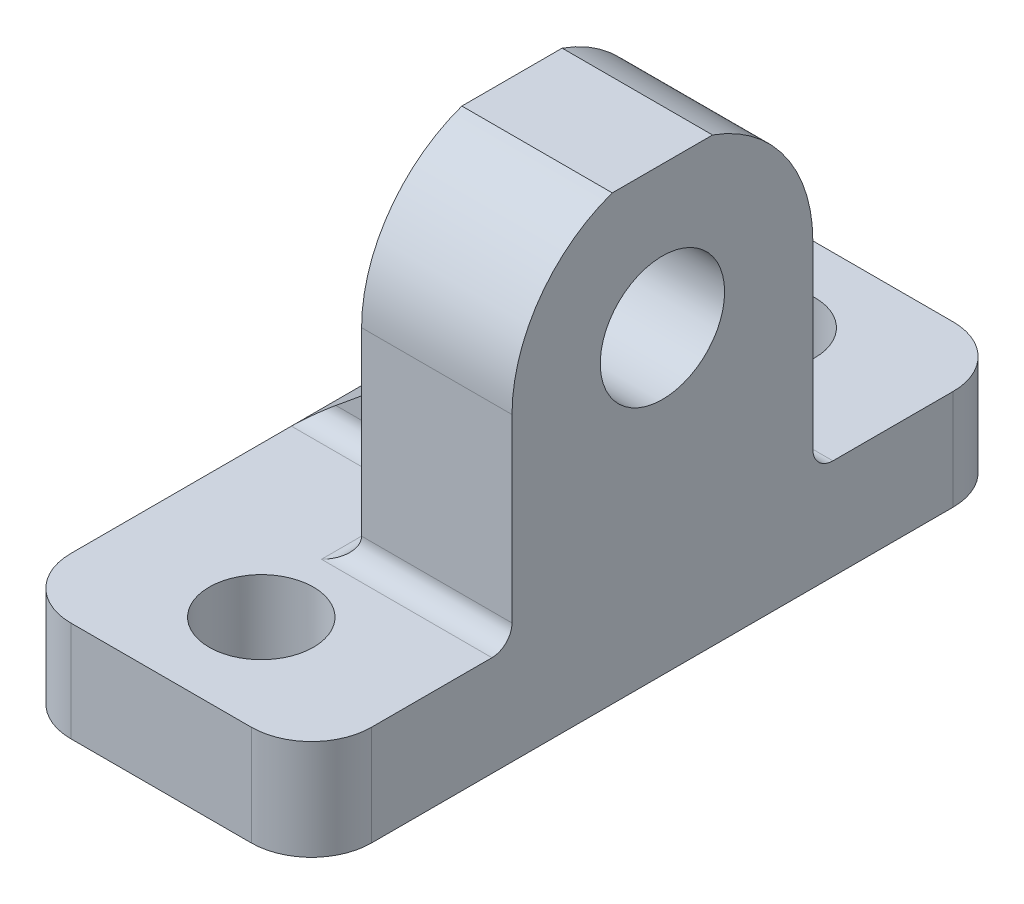
ISO-10303-21;
HEADER;
FILE_DESCRIPTION(('STEP AP214'),'2;1');
FILE_NAME('part.step','',(''),(''),'','','');
FILE_SCHEMA(('AUTOMOTIVE_DESIGN { 1 0 10303 214 1 1 1 1 }'));
ENDSEC;
DATA;
#1=APPLICATION_CONTEXT('core data for automotive mechanical design processes');
#2=APPLICATION_PROTOCOL_DEFINITION('international standard','automotive_design',2000,#1);
#3=PRODUCT_CONTEXT('',#1,'mechanical');
#4=PRODUCT('Part','Part','',(#3));
#5=PRODUCT_RELATED_PRODUCT_CATEGORY('part','',(#4));
#6=PRODUCT_DEFINITION_FORMATION('','',#4);
#7=PRODUCT_DEFINITION_CONTEXT('part definition',#1,'design');
#8=PRODUCT_DEFINITION('design','',#6,#7);
#9=PRODUCT_DEFINITION_SHAPE('','',#8);
#10=(LENGTH_UNIT() NAMED_UNIT(*) SI_UNIT(.MILLI.,.METRE.));
#11=(NAMED_UNIT(*) PLANE_ANGLE_UNIT() SI_UNIT($,.RADIAN.));
#12=(NAMED_UNIT(*) SI_UNIT($,.STERADIAN.) SOLID_ANGLE_UNIT());
#13=UNCERTAINTY_MEASURE_WITH_UNIT(LENGTH_MEASURE(1.E-05),#10,'distance_accuracy_value','');
#14=(GEOMETRIC_REPRESENTATION_CONTEXT(3) GLOBAL_UNCERTAINTY_ASSIGNED_CONTEXT((#13)) GLOBAL_UNIT_ASSIGNED_CONTEXT((#10,
#11,#12)) REPRESENTATION_CONTEXT('',''));
#15=CARTESIAN_POINT('',(0.,0.,0.));
#16=DIRECTION('',(0.,0.,1.));
#17=DIRECTION('',(1.,0.,0.));
#18=AXIS2_PLACEMENT_3D('',#15,#16,#17);
#19=CARTESIAN_POINT('',(0.,12.5,0.));
#20=DIRECTION('',(-1.,0.,0.));
#21=DIRECTION('',(0.,0.,1.));
#22=AXIS2_PLACEMENT_3D('',#19,#20,#21);
#23=PLANE('',#22);
#24=DIRECTION('',(0.,0.,-1.));
#25=VECTOR('',#24,1.);
#26=CARTESIAN_POINT('',(0.,-2.5,17.5));
#27=LINE('',#26,#25);
#28=CARTESIAN_POINT('',(0.,-2.5,14.5));
#29=VERTEX_POINT('',#28);
#30=CARTESIAN_POINT('',(0.,-2.5,-14.5));
#31=VERTEX_POINT('',#30);
#32=EDGE_CURVE('E356',#29,#31,#27,.T.);
#33=ORIENTED_EDGE('',*,*,#32,.F.);
#34=DIRECTION('',(0.,-1.,0.));
#35=VECTOR('',#34,1.);
#36=CARTESIAN_POINT('',(0.,2.5,14.5));
#37=LINE('',#36,#35);
#38=CARTESIAN_POINT('',(0.,2.5,14.5));
#39=VERTEX_POINT('',#38);
#40=EDGE_CURVE('E11',#29,#39,#37,.F.);
#41=ORIENTED_EDGE('',*,*,#40,.T.);
#42=DIRECTION('',(0.,0.,1.));
#43=VECTOR('',#42,1.);
#44=CARTESIAN_POINT('',(0.,2.5,17.5));
#45=LINE('',#44,#43);
#46=CARTESIAN_POINT('',(0.,2.5,3.5));
#47=VERTEX_POINT('',#46);
#48=EDGE_CURVE('E368',#47,#39,#45,.T.);
#49=ORIENTED_EDGE('',*,*,#48,.F.);
#50=DIRECTION('',(0.,0.,1.));
#51=VECTOR('',#50,1.);
#52=CARTESIAN_POINT('',(0.,2.5,-13.5882547968719));
#53=LINE('',#52,#51);
#54=CARTESIAN_POINT('',(0.,2.5,-3.5));
#55=VERTEX_POINT('',#54);
#56=EDGE_CURVE('E768',#55,#47,#53,.T.);
#57=ORIENTED_EDGE('',*,*,#56,.F.);
#58=DIRECTION('',(0.,0.,1.));
#59=VECTOR('',#58,1.);
#60=CARTESIAN_POINT('',(0.,2.5,-7.5));
#61=LINE('',#60,#59);
#62=CARTESIAN_POINT('',(0.,2.5,-14.5));
#63=VERTEX_POINT('',#62);
#64=EDGE_CURVE('E358',#63,#55,#61,.T.);
#65=ORIENTED_EDGE('',*,*,#64,.F.);
#66=DIRECTION('',(0.,1.,0.));
#67=VECTOR('',#66,1.);
#68=CARTESIAN_POINT('',(0.,-2.5,-14.5));
#69=LINE('',#68,#67);
#70=EDGE_CURVE('E52',#63,#31,#69,.F.);
#71=ORIENTED_EDGE('',*,*,#70,.T.);
#72=EDGE_LOOP('',(#33,#41,#49,#57,#65,#71));
#73=FACE_BOUND('',#72,.T.);
#74=ADVANCED_FACE('F43',(#73),#23,.T.);
#75=CARTESIAN_POINT('',(15.,12.5,0.));
#76=DIRECTION('',(-1.,0.,0.));
#77=DIRECTION('',(0.,0.,1.));
#78=AXIS2_PLACEMENT_3D('',#75,#76,#77);
#79=PLANE('',#78);
#80=DIRECTION('',(0.,0.,-1.));
#81=VECTOR('',#80,1.);
#82=CARTESIAN_POINT('',(15.,-2.5,17.5));
#83=LINE('',#82,#81);
#84=CARTESIAN_POINT('',(15.,-2.5,14.5));
#85=VERTEX_POINT('',#84);
#86=CARTESIAN_POINT('',(15.,-2.5,-14.5));
#87=VERTEX_POINT('',#86);
#88=EDGE_CURVE('E388',#85,#87,#83,.T.);
#89=ORIENTED_EDGE('',*,*,#88,.T.);
#90=DIRECTION('',(0.,1.,0.));
#91=VECTOR('',#90,1.);
#92=CARTESIAN_POINT('',(15.,12.5,-14.5));
#93=LINE('',#92,#91);
#94=CARTESIAN_POINT('',(15.,2.5,-14.5));
#95=VERTEX_POINT('',#94);
#96=EDGE_CURVE('E312',#87,#95,#93,.T.);
#97=ORIENTED_EDGE('',*,*,#96,.T.);
#98=DIRECTION('',(0.,0.,1.));
#99=VECTOR('',#98,1.);
#100=CARTESIAN_POINT('',(15.,2.5,-7.5));
#101=LINE('',#100,#99);
#102=CARTESIAN_POINT('',(15.,2.5,-8.5));
#103=VERTEX_POINT('',#102);
#104=EDGE_CURVE('E367',#95,#103,#101,.T.);
#105=ORIENTED_EDGE('',*,*,#104,.T.);
#106=CARTESIAN_POINT('',(15.,3.5,-8.5));
#107=DIRECTION('',(-1.,0.,0.));
#108=DIRECTION('',(0.,0.,1.));
#109=AXIS2_PLACEMENT_3D('',#106,#107,#108);
#110=CIRCLE('',#109,1.);
#111=CARTESIAN_POINT('',(15.,3.5,-7.5));
#112=VERTEX_POINT('',#111);
#113=EDGE_CURVE('E283',#103,#112,#110,.T.);
#114=ORIENTED_EDGE('',*,*,#113,.T.);
#115=DIRECTION('',(0.,1.,0.));
#116=VECTOR('',#115,1.);
#117=CARTESIAN_POINT('',(15.,12.5,-7.5));
#118=LINE('',#117,#116);
#119=CARTESIAN_POINT('',(15.,12.5,-7.5));
#120=VERTEX_POINT('',#119);
#121=EDGE_CURVE('E714',#112,#120,#118,.T.);
#122=ORIENTED_EDGE('',*,*,#121,.T.);
#123=CARTESIAN_POINT('',(15.,12.5,0.));
#124=DIRECTION('',(1.,0.,0.));
#125=DIRECTION('',(0.,0.,1.));
#126=AXIS2_PLACEMENT_3D('',#123,#124,#125);
#127=CIRCLE('',#126,7.5);
#128=CARTESIAN_POINT('',(15.,19.5710678118655,-2.5));
#129=VERTEX_POINT('',#128);
#130=EDGE_CURVE('E717',#120,#129,#127,.T.);
#131=ORIENTED_EDGE('',*,*,#130,.T.);
#132=DIRECTION('',(0.,0.,1.));
#133=VECTOR('',#132,1.);
#134=CARTESIAN_POINT('',(15.,19.5710678118655,2.5));
#135=LINE('',#134,#133);
#136=CARTESIAN_POINT('',(15.,19.5710678118655,2.5));
#137=VERTEX_POINT('',#136);
#138=EDGE_CURVE('E720',#129,#137,#135,.T.);
#139=ORIENTED_EDGE('',*,*,#138,.T.);
#140=CARTESIAN_POINT('',(15.,12.5,0.));
#141=DIRECTION('',(1.,0.,0.));
#142=DIRECTION('',(0.,0.,1.));
#143=AXIS2_PLACEMENT_3D('',#140,#141,#142);
#144=CIRCLE('',#143,7.5);
#145=CARTESIAN_POINT('',(15.,12.5,7.5));
#146=VERTEX_POINT('',#145);
#147=EDGE_CURVE('E217',#137,#146,#144,.T.);
#148=ORIENTED_EDGE('',*,*,#147,.T.);
#149=DIRECTION('',(0.,-1.,0.));
#150=VECTOR('',#149,1.);
#151=CARTESIAN_POINT('',(15.,12.5,7.5));
#152=LINE('',#151,#150);
#153=CARTESIAN_POINT('',(15.,3.5,7.49999999999999));
#154=VERTEX_POINT('',#153);
#155=EDGE_CURVE('E398',#146,#154,#152,.T.);
#156=ORIENTED_EDGE('',*,*,#155,.T.);
#157=CARTESIAN_POINT('',(15.,3.5,8.49999999999999));
#158=DIRECTION('',(-1.,0.,0.));
#159=DIRECTION('',(0.,0.,1.));
#160=AXIS2_PLACEMENT_3D('',#157,#158,#159);
#161=CIRCLE('',#160,1.);
#162=CARTESIAN_POINT('',(15.,2.5,8.49999999999999));
#163=VERTEX_POINT('',#162);
#164=EDGE_CURVE('E280',#154,#163,#161,.T.);
#165=ORIENTED_EDGE('',*,*,#164,.T.);
#166=DIRECTION('',(0.,0.,1.));
#167=VECTOR('',#166,1.);
#168=CARTESIAN_POINT('',(15.,2.5,17.5));
#169=LINE('',#168,#167);
#170=CARTESIAN_POINT('',(15.,2.5,14.5));
#171=VERTEX_POINT('',#170);
#172=EDGE_CURVE('E392',#163,#171,#169,.T.);
#173=ORIENTED_EDGE('',*,*,#172,.T.);
#174=DIRECTION('',(0.,-1.,0.));
#175=VECTOR('',#174,1.);
#176=CARTESIAN_POINT('',(15.,12.5,14.5));
#177=LINE('',#176,#175);
#178=EDGE_CURVE('E293',#171,#85,#177,.T.);
#179=ORIENTED_EDGE('',*,*,#178,.T.);
#180=EDGE_LOOP('',(#89,#97,#105,#114,#122,#131,#139,#148,#156,#165,#173,#179));
#181=FACE_BOUND('',#180,.T.);
#182=CARTESIAN_POINT('',(15.,12.5,0.));
#183=DIRECTION('',(1.,0.,0.));
#184=DIRECTION('',(0.,0.,-1.));
#185=AXIS2_PLACEMENT_3D('',#182,#183,#184);
#186=CIRCLE('',#185,3.1);
#187=CARTESIAN_POINT('',(15.,12.5,-3.1));
#188=VERTEX_POINT('',#187);
#189=EDGE_CURVE('E404',#188,#188,#186,.T.);
#190=ORIENTED_EDGE('',*,*,#189,.F.);
#191=EDGE_LOOP('',(#190));
#192=FACE_BOUND('',#191,.T.);
#193=ADVANCED_FACE('F385',(#181,#192),#79,.F.);
#194=CARTESIAN_POINT('',(15.,-2.5,-17.5));
#195=DIRECTION('',(0.,0.,1.));
#196=DIRECTION('',(1.,0.,0.));
#197=AXIS2_PLACEMENT_3D('',#194,#195,#196);
#198=PLANE('',#197);
#199=DIRECTION('',(-1.,0.,0.));
#200=VECTOR('',#199,1.);
#201=CARTESIAN_POINT('',(15.,2.5,-17.5));
#202=LINE('',#201,#200);
#203=CARTESIAN_POINT('',(12.,2.5,-17.5));
#204=VERTEX_POINT('',#203);
#205=CARTESIAN_POINT('',(3.,2.5,-17.5));
#206=VERTEX_POINT('',#205);
#207=EDGE_CURVE('E232',#204,#206,#202,.T.);
#208=ORIENTED_EDGE('',*,*,#207,.F.);
#209=DIRECTION('',(0.,1.,0.));
#210=VECTOR('',#209,1.);
#211=CARTESIAN_POINT('',(12.,-2.5,-17.5));
#212=LINE('',#211,#210);
#213=CARTESIAN_POINT('',(12.,-2.5,-17.5));
#214=VERTEX_POINT('',#213);
#215=EDGE_CURVE('E326',#204,#214,#212,.F.);
#216=ORIENTED_EDGE('',*,*,#215,.T.);
#217=DIRECTION('',(-1.,0.,0.));
#218=VECTOR('',#217,1.);
#219=CARTESIAN_POINT('',(15.,-2.5,-17.5));
#220=LINE('',#219,#218);
#221=CARTESIAN_POINT('',(3.,-2.5,-17.5));
#222=VERTEX_POINT('',#221);
#223=EDGE_CURVE('E375',#214,#222,#220,.T.);
#224=ORIENTED_EDGE('',*,*,#223,.T.);
#225=DIRECTION('',(0.,1.,0.));
#226=VECTOR('',#225,1.);
#227=CARTESIAN_POINT('',(3.,2.5,-17.5));
#228=LINE('',#227,#226);
#229=EDGE_CURVE('E322',#222,#206,#228,.T.);
#230=ORIENTED_EDGE('',*,*,#229,.T.);
#231=EDGE_LOOP('',(#208,#216,#224,#230));
#232=FACE_BOUND('',#231,.T.);
#233=ADVANCED_FACE('F373',(#232),#198,.F.);
#234=CARTESIAN_POINT('',(15.,2.5,-7.5));
#235=DIRECTION('',(0.,-1.,0.));
#236=DIRECTION('',(0.,0.,-1.));
#237=AXIS2_PLACEMENT_3D('',#234,#235,#236);
#238=PLANE('',#237);
#239=CARTESIAN_POINT('',(7.5,2.5,-12.5));
#240=DIRECTION('',(0.,-1.,0.));
#241=DIRECTION('',(0.,0.,-1.));
#242=AXIS2_PLACEMENT_3D('',#239,#240,#241);
#243=CIRCLE('',#242,2.6);
#244=CARTESIAN_POINT('',(7.5,2.5,-15.1));
#245=VERTEX_POINT('',#244);
#246=EDGE_CURVE('E704',#245,#245,#243,.T.);
#247=ORIENTED_EDGE('',*,*,#246,.T.);
#248=EDGE_LOOP('',(#247));
#249=FACE_BOUND('',#248,.T.);
#250=ORIENTED_EDGE('',*,*,#104,.F.);
#251=CARTESIAN_POINT('',(12.,2.5,-14.5));
#252=DIRECTION('',(0.,-1.,0.));
#253=DIRECTION('',(0.,0.,-1.));
#254=AXIS2_PLACEMENT_3D('',#251,#252,#253);
#255=CIRCLE('',#254,3.);
#256=EDGE_CURVE('E319',#95,#204,#255,.F.);
#257=ORIENTED_EDGE('',*,*,#256,.T.);
#258=ORIENTED_EDGE('',*,*,#207,.T.);
#259=CARTESIAN_POINT('',(3.,2.5,-14.5));
#260=DIRECTION('',(0.,-1.,0.));
#261=DIRECTION('',(0.,0.,-1.));
#262=AXIS2_PLACEMENT_3D('',#259,#260,#261);
#263=CIRCLE('',#262,3.);
#264=EDGE_CURVE('E316',#206,#63,#263,.F.);
#265=ORIENTED_EDGE('',*,*,#264,.T.);
#266=ORIENTED_EDGE('',*,*,#64,.T.);
#267=DIRECTION('',(1.,0.,0.));
#268=VECTOR('',#267,1.);
#269=CARTESIAN_POINT('',(7.5,2.5,-3.5));
#270=LINE('',#269,#268);
#271=CARTESIAN_POINT('',(6.5,2.5,-3.5));
#272=VERTEX_POINT('',#271);
#273=EDGE_CURVE('E261',#55,#272,#270,.T.);
#274=ORIENTED_EDGE('',*,*,#273,.T.);
#275=DIRECTION('',(0.,0.,-1.));
#276=VECTOR('',#275,1.);
#277=CARTESIAN_POINT('',(6.5,2.5,-7.5));
#278=LINE('',#277,#276);
#279=CARTESIAN_POINT('',(6.5,2.5,-8.5));
#280=VERTEX_POINT('',#279);
#281=EDGE_CURVE('E258',#272,#280,#278,.T.);
#282=ORIENTED_EDGE('',*,*,#281,.T.);
#283=DIRECTION('',(-1.,0.,0.));
#284=VECTOR('',#283,1.);
#285=CARTESIAN_POINT('',(15.,2.5,-8.5));
#286=LINE('',#285,#284);
#287=EDGE_CURVE('E264',#280,#103,#286,.F.);
#288=ORIENTED_EDGE('',*,*,#287,.T.);
#289=EDGE_LOOP('',(#250,#257,#258,#265,#266,#274,#282,#288));
#290=FACE_BOUND('',#289,.T.);
#291=ADVANCED_FACE('F378',(#249,#290),#238,.F.);
#292=CARTESIAN_POINT('',(15.,12.5,-7.5));
#293=DIRECTION('',(0.,0.,1.));
#294=DIRECTION('',(0.,-1.,0.));
#295=AXIS2_PLACEMENT_3D('',#292,#293,#294);
#296=PLANE('',#295);
#297=ORIENTED_EDGE('',*,*,#121,.F.);
#298=DIRECTION('',(-1.,0.,0.));
#299=VECTOR('',#298,1.);
#300=CARTESIAN_POINT('',(7.5,3.5,-7.5));
#301=LINE('',#300,#299);
#302=CARTESIAN_POINT('',(7.5,3.5,-7.5));
#303=VERTEX_POINT('',#302);
#304=EDGE_CURVE('E254',#112,#303,#301,.T.);
#305=ORIENTED_EDGE('',*,*,#304,.T.);
#306=DIRECTION('',(0.,1.,0.));
#307=VECTOR('',#306,1.);
#308=CARTESIAN_POINT('',(7.5,-6.51387818865997,-7.5));
#309=LINE('',#308,#307);
#310=CARTESIAN_POINT('',(7.5,12.5,-7.5));
#311=VERTEX_POINT('',#310);
#312=EDGE_CURVE('E214',#303,#311,#309,.T.);
#313=ORIENTED_EDGE('',*,*,#312,.T.);
#314=DIRECTION('',(-1.,0.,0.));
#315=VECTOR('',#314,1.);
#316=CARTESIAN_POINT('',(15.,12.5,-7.5));
#317=LINE('',#316,#315);
#318=EDGE_CURVE('E223',#120,#311,#317,.T.);
#319=ORIENTED_EDGE('',*,*,#318,.F.);
#320=EDGE_LOOP('',(#297,#305,#313,#319));
#321=FACE_BOUND('',#320,.T.);
#322=ADVANCED_FACE('F454',(#321),#296,.F.);
#323=CARTESIAN_POINT('',(15.,12.5,0.));
#324=DIRECTION('',(-1.,0.,0.));
#325=DIRECTION('',(0.,0.,1.));
#326=AXIS2_PLACEMENT_3D('',#323,#324,#325);
#327=CYLINDRICAL_SURFACE('',#326,7.5);
#328=ORIENTED_EDGE('',*,*,#318,.T.);
#329=CARTESIAN_POINT('',(7.5,12.5,0.));
#330=DIRECTION('',(1.,0.,0.));
#331=DIRECTION('',(0.,0.,-1.));
#332=AXIS2_PLACEMENT_3D('',#329,#330,#331);
#333=CIRCLE('',#332,7.5);
#334=CARTESIAN_POINT('',(7.5,19.5710678118655,-2.5));
#335=VERTEX_POINT('',#334);
#336=EDGE_CURVE('E213',#311,#335,#333,.T.);
#337=ORIENTED_EDGE('',*,*,#336,.T.);
#338=DIRECTION('',(-1.,0.,0.));
#339=VECTOR('',#338,1.);
#340=CARTESIAN_POINT('',(15.,19.5710678118655,-2.5));
#341=LINE('',#340,#339);
#342=EDGE_CURVE('E196',#129,#335,#341,.T.);
#343=ORIENTED_EDGE('',*,*,#342,.F.);
#344=ORIENTED_EDGE('',*,*,#130,.F.);
#345=EDGE_LOOP('',(#328,#337,#343,#344));
#346=FACE_BOUND('',#345,.T.);
#347=ADVANCED_FACE('F451',(#346),#327,.T.);
#348=CARTESIAN_POINT('',(15.,19.5710678118655,2.5));
#349=DIRECTION('',(0.,-1.,0.));
#350=DIRECTION('',(0.,0.,-1.));
#351=AXIS2_PLACEMENT_3D('',#348,#349,#350);
#352=PLANE('',#351);
#353=ORIENTED_EDGE('',*,*,#342,.T.);
#354=DIRECTION('',(0.,0.,1.));
#355=VECTOR('',#354,1.);
#356=CARTESIAN_POINT('',(7.5,19.5710678118655,-13.5882547968719));
#357=LINE('',#356,#355);
#358=CARTESIAN_POINT('',(7.5,19.5710678118655,2.5));
#359=VERTEX_POINT('',#358);
#360=EDGE_CURVE('E188',#335,#359,#357,.T.);
#361=ORIENTED_EDGE('',*,*,#360,.T.);
#362=DIRECTION('',(-1.,0.,0.));
#363=VECTOR('',#362,1.);
#364=CARTESIAN_POINT('',(15.,19.5710678118655,2.5));
#365=LINE('',#364,#363);
#366=EDGE_CURVE('E193',#137,#359,#365,.T.);
#367=ORIENTED_EDGE('',*,*,#366,.F.);
#368=ORIENTED_EDGE('',*,*,#138,.F.);
#369=EDGE_LOOP('',(#353,#361,#367,#368));
#370=FACE_BOUND('',#369,.T.);
#371=ADVANCED_FACE('F190',(#370),#352,.F.);
#372=CARTESIAN_POINT('',(15.,12.5,0.));
#373=DIRECTION('',(-1.,0.,0.));
#374=DIRECTION('',(0.,0.,1.));
#375=AXIS2_PLACEMENT_3D('',#372,#373,#374);
#376=CYLINDRICAL_SURFACE('',#375,7.5);
#377=ORIENTED_EDGE('',*,*,#366,.T.);
#378=CARTESIAN_POINT('',(7.5,12.5,0.));
#379=DIRECTION('',(1.,0.,0.));
#380=DIRECTION('',(0.,0.,-1.));
#381=AXIS2_PLACEMENT_3D('',#378,#379,#380);
#382=CIRCLE('',#381,7.5);
#383=CARTESIAN_POINT('',(7.5,12.5,7.5));
#384=VERTEX_POINT('',#383);
#385=EDGE_CURVE('E205',#359,#384,#382,.T.);
#386=ORIENTED_EDGE('',*,*,#385,.T.);
#387=DIRECTION('',(-1.,0.,0.));
#388=VECTOR('',#387,1.);
#389=CARTESIAN_POINT('',(15.,12.5,7.5));
#390=LINE('',#389,#388);
#391=EDGE_CURVE('E219',#146,#384,#390,.T.);
#392=ORIENTED_EDGE('',*,*,#391,.F.);
#393=ORIENTED_EDGE('',*,*,#147,.F.);
#394=EDGE_LOOP('',(#377,#386,#392,#393));
#395=FACE_BOUND('',#394,.T.);
#396=ADVANCED_FACE('F216',(#395),#376,.T.);
#397=CARTESIAN_POINT('',(15.,12.5,7.5));
#398=DIRECTION('',(0.,0.,-1.));
#399=DIRECTION('',(0.,1.,0.));
#400=AXIS2_PLACEMENT_3D('',#397,#398,#399);
#401=PLANE('',#400);
#402=DIRECTION('',(0.,1.,0.));
#403=VECTOR('',#402,1.);
#404=CARTESIAN_POINT('',(7.5,-6.51387818865997,7.5));
#405=LINE('',#404,#403);
#406=CARTESIAN_POINT('',(7.5,3.5,7.5));
#407=VERTEX_POINT('',#406);
#408=EDGE_CURVE('E201',#407,#384,#405,.T.);
#409=ORIENTED_EDGE('',*,*,#408,.F.);
#410=DIRECTION('',(-1.,0.,0.));
#411=VECTOR('',#410,1.);
#412=CARTESIAN_POINT('',(15.,3.5,7.49999999999999));
#413=LINE('',#412,#411);
#414=EDGE_CURVE('E251',#407,#154,#413,.F.);
#415=ORIENTED_EDGE('',*,*,#414,.T.);
#416=ORIENTED_EDGE('',*,*,#155,.F.);
#417=ORIENTED_EDGE('',*,*,#391,.T.);
#418=EDGE_LOOP('',(#409,#415,#416,#417));
#419=FACE_BOUND('',#418,.T.);
#420=ADVANCED_FACE('F442',(#419),#401,.F.);
#421=CARTESIAN_POINT('',(15.,2.5,17.5));
#422=DIRECTION('',(0.,-1.,0.));
#423=DIRECTION('',(0.,0.,-1.));
#424=AXIS2_PLACEMENT_3D('',#421,#422,#423);
#425=PLANE('',#424);
#426=CARTESIAN_POINT('',(7.5,2.5,12.5));
#427=DIRECTION('',(0.,-1.,0.));
#428=DIRECTION('',(0.,0.,-1.));
#429=AXIS2_PLACEMENT_3D('',#426,#427,#428);
#430=CIRCLE('',#429,2.6);
#431=CARTESIAN_POINT('',(7.5,2.5,9.9));
#432=VERTEX_POINT('',#431);
#433=EDGE_CURVE('E708',#432,#432,#430,.T.);
#434=ORIENTED_EDGE('',*,*,#433,.T.);
#435=EDGE_LOOP('',(#434));
#436=FACE_BOUND('',#435,.T.);
#437=DIRECTION('',(-1.,0.,0.));
#438=VECTOR('',#437,1.);
#439=CARTESIAN_POINT('',(15.,2.5,17.5));
#440=LINE('',#439,#438);
#441=CARTESIAN_POINT('',(12.,2.5,17.5));
#442=VERTEX_POINT('',#441);
#443=CARTESIAN_POINT('',(3.,2.5,17.5));
#444=VERTEX_POINT('',#443);
#445=EDGE_CURVE('E225',#442,#444,#440,.T.);
#446=ORIENTED_EDGE('',*,*,#445,.F.);
#447=CARTESIAN_POINT('',(12.,2.5,14.5));
#448=DIRECTION('',(0.,-1.,0.));
#449=DIRECTION('',(0.,0.,-1.));
#450=AXIS2_PLACEMENT_3D('',#447,#448,#449);
#451=CIRCLE('',#450,3.);
#452=EDGE_CURVE('E350',#442,#171,#451,.F.);
#453=ORIENTED_EDGE('',*,*,#452,.T.);
#454=ORIENTED_EDGE('',*,*,#172,.F.);
#455=DIRECTION('',(-1.,0.,0.));
#456=VECTOR('',#455,1.);
#457=CARTESIAN_POINT('',(7.5,2.5,8.49999999999999));
#458=LINE('',#457,#456);
#459=CARTESIAN_POINT('',(6.5,2.5,8.49999999999999));
#460=VERTEX_POINT('',#459);
#461=EDGE_CURVE('E247',#163,#460,#458,.T.);
#462=ORIENTED_EDGE('',*,*,#461,.T.);
#463=DIRECTION('',(0.,0.,-1.));
#464=VECTOR('',#463,1.);
#465=CARTESIAN_POINT('',(6.5,2.5,2.5));
#466=LINE('',#465,#464);
#467=CARTESIAN_POINT('',(6.5,2.5,3.5));
#468=VERTEX_POINT('',#467);
#469=EDGE_CURVE('E244',#460,#468,#466,.T.);
#470=ORIENTED_EDGE('',*,*,#469,.T.);
#471=DIRECTION('',(-1.,0.,0.));
#472=VECTOR('',#471,1.);
#473=CARTESIAN_POINT('',(0.,2.5,3.5));
#474=LINE('',#473,#472);
#475=EDGE_CURVE('E240',#468,#47,#474,.T.);
#476=ORIENTED_EDGE('',*,*,#475,.T.);
#477=ORIENTED_EDGE('',*,*,#48,.T.);
#478=CARTESIAN_POINT('',(3.,2.5,14.5));
#479=DIRECTION('',(0.,-1.,0.));
#480=DIRECTION('',(0.,0.,-1.));
#481=AXIS2_PLACEMENT_3D('',#478,#479,#480);
#482=CIRCLE('',#481,3.);
#483=EDGE_CURVE('E64',#39,#444,#482,.F.);
#484=ORIENTED_EDGE('',*,*,#483,.T.);
#485=EDGE_LOOP('',(#446,#453,#454,#462,#470,#476,#477,#484));
#486=FACE_BOUND('',#485,.T.);
#487=ADVANCED_FACE('F439',(#436,#486),#425,.F.);
#488=CARTESIAN_POINT('',(15.,-2.5,17.5));
#489=DIRECTION('',(0.,0.,-1.));
#490=DIRECTION('',(-1.,0.,0.));
#491=AXIS2_PLACEMENT_3D('',#488,#489,#490);
#492=PLANE('',#491);
#493=DIRECTION('',(-1.,0.,0.));
#494=VECTOR('',#493,1.);
#495=CARTESIAN_POINT('',(15.,-2.5,17.5));
#496=LINE('',#495,#494);
#497=CARTESIAN_POINT('',(12.,-2.5,17.5));
#498=VERTEX_POINT('',#497);
#499=CARTESIAN_POINT('',(3.,-2.5,17.5));
#500=VERTEX_POINT('',#499);
#501=EDGE_CURVE('E396',#498,#500,#496,.T.);
#502=ORIENTED_EDGE('',*,*,#501,.F.);
#503=DIRECTION('',(0.,-1.,0.));
#504=VECTOR('',#503,1.);
#505=CARTESIAN_POINT('',(12.,-2.5,17.5));
#506=LINE('',#505,#504);
#507=EDGE_CURVE('E345',#498,#442,#506,.F.);
#508=ORIENTED_EDGE('',*,*,#507,.T.);
#509=ORIENTED_EDGE('',*,*,#445,.T.);
#510=DIRECTION('',(0.,-1.,0.));
#511=VECTOR('',#510,1.);
#512=CARTESIAN_POINT('',(3.,-2.5,17.5));
#513=LINE('',#512,#511);
#514=EDGE_CURVE('E341',#444,#500,#513,.T.);
#515=ORIENTED_EDGE('',*,*,#514,.T.);
#516=EDGE_LOOP('',(#502,#508,#509,#515));
#517=FACE_BOUND('',#516,.T.);
#518=ADVANCED_FACE('F412',(#517),#492,.F.);
#519=CARTESIAN_POINT('',(15.,-2.5,17.5));
#520=DIRECTION('',(0.,1.,0.));
#521=DIRECTION('',(0.,0.,1.));
#522=AXIS2_PLACEMENT_3D('',#519,#520,#521);
#523=PLANE('',#522);
#524=CARTESIAN_POINT('',(7.5,-2.5,-12.5));
#525=DIRECTION('',(0.,1.,0.));
#526=DIRECTION('',(0.,0.,1.));
#527=AXIS2_PLACEMENT_3D('',#524,#525,#526);
#528=CIRCLE('',#527,2.6);
#529=CARTESIAN_POINT('',(7.5,-2.5,-9.9));
#530=VERTEX_POINT('',#529);
#531=EDGE_CURVE('E752',#530,#530,#528,.T.);
#532=ORIENTED_EDGE('',*,*,#531,.T.);
#533=EDGE_LOOP('',(#532));
#534=FACE_BOUND('',#533,.T.);
#535=CARTESIAN_POINT('',(7.5,-2.5,12.5));
#536=DIRECTION('',(0.,1.,0.));
#537=DIRECTION('',(0.,0.,1.));
#538=AXIS2_PLACEMENT_3D('',#535,#536,#537);
#539=CIRCLE('',#538,2.6);
#540=CARTESIAN_POINT('',(7.5,-2.5,15.1));
#541=VERTEX_POINT('',#540);
#542=EDGE_CURVE('E751',#541,#541,#539,.T.);
#543=ORIENTED_EDGE('',*,*,#542,.T.);
#544=EDGE_LOOP('',(#543));
#545=FACE_BOUND('',#544,.T.);
#546=ORIENTED_EDGE('',*,*,#223,.F.);
#547=CARTESIAN_POINT('',(12.,-2.5,-14.5));
#548=DIRECTION('',(0.,1.,0.));
#549=DIRECTION('',(0.,0.,1.));
#550=AXIS2_PLACEMENT_3D('',#547,#548,#549);
#551=CIRCLE('',#550,3.);
#552=EDGE_CURVE('E338',#214,#87,#551,.F.);
#553=ORIENTED_EDGE('',*,*,#552,.T.);
#554=ORIENTED_EDGE('',*,*,#88,.F.);
#555=CARTESIAN_POINT('',(12.,-2.5,14.5));
#556=DIRECTION('',(0.,1.,0.));
#557=DIRECTION('',(0.,0.,1.));
#558=AXIS2_PLACEMENT_3D('',#555,#556,#557);
#559=CIRCLE('',#558,3.);
#560=EDGE_CURVE('E335',#85,#498,#559,.F.);
#561=ORIENTED_EDGE('',*,*,#560,.T.);
#562=ORIENTED_EDGE('',*,*,#501,.T.);
#563=CARTESIAN_POINT('',(3.,-2.5,14.5));
#564=DIRECTION('',(0.,1.,0.));
#565=DIRECTION('',(0.,0.,1.));
#566=AXIS2_PLACEMENT_3D('',#563,#564,#565);
#567=CIRCLE('',#566,3.);
#568=EDGE_CURVE('E332',#500,#29,#567,.F.);
#569=ORIENTED_EDGE('',*,*,#568,.T.);
#570=ORIENTED_EDGE('',*,*,#32,.T.);
#571=CARTESIAN_POINT('',(3.,-2.5,-14.5));
#572=DIRECTION('',(0.,1.,0.));
#573=DIRECTION('',(0.,0.,1.));
#574=AXIS2_PLACEMENT_3D('',#571,#572,#573);
#575=CIRCLE('',#574,3.);
#576=EDGE_CURVE('E329',#31,#222,#575,.F.);
#577=ORIENTED_EDGE('',*,*,#576,.T.);
#578=EDGE_LOOP('',(#546,#553,#554,#561,#562,#569,#570,#577));
#579=FACE_BOUND('',#578,.T.);
#580=ADVANCED_FACE('F363',(#534,#545,#579),#523,.F.);
#581=CARTESIAN_POINT('',(15.,12.5,0.));
#582=DIRECTION('',(-1.,0.,0.));
#583=DIRECTION('',(0.,0.,1.));
#584=AXIS2_PLACEMENT_3D('',#581,#582,#583);
#585=CYLINDRICAL_SURFACE('',#584,3.1);
#586=CARTESIAN_POINT('',(7.5,12.5,0.));
#587=DIRECTION('',(1.,0.,0.));
#588=DIRECTION('',(0.,0.,-1.));
#589=AXIS2_PLACEMENT_3D('',#586,#587,#588);
#590=CIRCLE('',#589,3.1);
#591=CARTESIAN_POINT('',(7.5,12.5,-3.1));
#592=VERTEX_POINT('',#591);
#593=EDGE_CURVE('E236',#592,#592,#590,.T.);
#594=ORIENTED_EDGE('',*,*,#593,.F.);
#595=EDGE_LOOP('',(#594));
#596=FACE_BOUND('',#595,.T.);
#597=ORIENTED_EDGE('',*,*,#189,.T.);
#598=EDGE_LOOP('',(#597));
#599=FACE_BOUND('',#598,.T.);
#600=ADVANCED_FACE('F435',(#596,#599),#585,.F.);
#601=CARTESIAN_POINT('',(7.5,-2.5,12.5));
#602=DIRECTION('',(0.,1.,0.));
#603=DIRECTION('',(0.,0.,1.));
#604=AXIS2_PLACEMENT_3D('',#601,#602,#603);
#605=CYLINDRICAL_SURFACE('',#604,2.6);
#606=ORIENTED_EDGE('',*,*,#542,.F.);
#607=EDGE_LOOP('',(#606));
#608=FACE_BOUND('',#607,.T.);
#609=ORIENTED_EDGE('',*,*,#433,.F.);
#610=EDGE_LOOP('',(#609));
#611=FACE_BOUND('',#610,.T.);
#612=ADVANCED_FACE('F630',(#608,#611),#605,.F.);
#613=CARTESIAN_POINT('',(7.5,-2.5,-12.5));
#614=DIRECTION('',(0.,1.,0.));
#615=DIRECTION('',(0.,0.,1.));
#616=AXIS2_PLACEMENT_3D('',#613,#614,#615);
#617=CYLINDRICAL_SURFACE('',#616,2.6);
#618=ORIENTED_EDGE('',*,*,#531,.F.);
#619=EDGE_LOOP('',(#618));
#620=FACE_BOUND('',#619,.T.);
#621=ORIENTED_EDGE('',*,*,#246,.F.);
#622=EDGE_LOOP('',(#621));
#623=FACE_BOUND('',#622,.T.);
#624=ADVANCED_FACE('F595',(#620,#623),#617,.F.);
#625=CARTESIAN_POINT('',(0.,-6.51387818865997,2.5));
#626=DIRECTION('',(0.,0.,-1.));
#627=DIRECTION('',(-1.,0.,0.));
#628=AXIS2_PLACEMENT_3D('',#625,#626,#627);
#629=PLANE('',#628);
#630=DIRECTION('',(0.772410174501282,0.635124021217037,0.));
#631=VECTOR('',#630,1.);
#632=CARTESIAN_POINT('',(7.5,8.66696972201766,2.5));
#633=LINE('',#632,#631);
#634=CARTESIAN_POINT('',(1.21615644928871,3.5,2.5));
#635=VERTEX_POINT('',#634);
#636=CARTESIAN_POINT('',(7.5,8.66696972201766,2.5));
#637=VERTEX_POINT('',#636);
#638=EDGE_CURVE('E302',#635,#637,#633,.T.);
#639=ORIENTED_EDGE('',*,*,#638,.F.);
#640=DIRECTION('',(-1.,0.,0.));
#641=VECTOR('',#640,1.);
#642=CARTESIAN_POINT('',(7.5,3.5,2.5));
#643=LINE('',#642,#641);
#644=CARTESIAN_POINT('',(7.5,3.5,2.5));
#645=VERTEX_POINT('',#644);
#646=EDGE_CURVE('E277',#635,#645,#643,.F.);
#647=ORIENTED_EDGE('',*,*,#646,.T.);
#648=DIRECTION('',(0.,1.,0.));
#649=VECTOR('',#648,1.);
#650=CARTESIAN_POINT('',(7.5,-6.51387818865997,2.5));
#651=LINE('',#650,#649);
#652=EDGE_CURVE('E741',#645,#637,#651,.T.);
#653=ORIENTED_EDGE('',*,*,#652,.T.);
#654=EDGE_LOOP('',(#639,#647,#653));
#655=FACE_BOUND('',#654,.T.);
#656=ADVANCED_FACE('F560',(#655),#629,.F.);
#657=CARTESIAN_POINT('',(7.5,-6.51387818865997,-7.5));
#658=DIRECTION('',(1.,0.,0.));
#659=DIRECTION('',(0.,0.,-1.));
#660=AXIS2_PLACEMENT_3D('',#657,#658,#659);
#661=PLANE('',#660);
#662=ORIENTED_EDGE('',*,*,#593,.T.);
#663=EDGE_LOOP('',(#662));
#664=FACE_BOUND('',#663,.T.);
#665=ORIENTED_EDGE('',*,*,#312,.F.);
#666=DIRECTION('',(0.,0.,-1.));
#667=VECTOR('',#666,1.);
#668=CARTESIAN_POINT('',(7.5,3.5,-2.5));
#669=LINE('',#668,#667);
#670=CARTESIAN_POINT('',(7.5,3.5,-2.5));
#671=VERTEX_POINT('',#670);
#672=EDGE_CURVE('E274',#303,#671,#669,.F.);
#673=ORIENTED_EDGE('',*,*,#672,.T.);
#674=DIRECTION('',(0.,1.,0.));
#675=VECTOR('',#674,1.);
#676=CARTESIAN_POINT('',(7.5,-6.51387818865997,-2.5));
#677=LINE('',#676,#675);
#678=CARTESIAN_POINT('',(7.5,8.66696972201766,-2.5));
#679=VERTEX_POINT('',#678);
#680=EDGE_CURVE('E745',#671,#679,#677,.T.);
#681=ORIENTED_EDGE('',*,*,#680,.T.);
#682=DIRECTION('',(0.,0.,1.));
#683=VECTOR('',#682,1.);
#684=CARTESIAN_POINT('',(7.5,8.66696972201766,-13.5882547968719));
#685=LINE('',#684,#683);
#686=EDGE_CURVE('E771',#679,#637,#685,.T.);
#687=ORIENTED_EDGE('',*,*,#686,.T.);
#688=ORIENTED_EDGE('',*,*,#652,.F.);
#689=DIRECTION('',(0.,0.,-1.));
#690=VECTOR('',#689,1.);
#691=CARTESIAN_POINT('',(7.5,3.5,7.5));
#692=LINE('',#691,#690);
#693=EDGE_CURVE('E271',#645,#407,#692,.F.);
#694=ORIENTED_EDGE('',*,*,#693,.T.);
#695=ORIENTED_EDGE('',*,*,#408,.T.);
#696=ORIENTED_EDGE('',*,*,#385,.F.);
#697=ORIENTED_EDGE('',*,*,#360,.F.);
#698=ORIENTED_EDGE('',*,*,#336,.F.);
#699=EDGE_LOOP('',(#665,#673,#681,#687,#688,#694,#695,#696,#697,#698));
#700=FACE_BOUND('',#699,.T.);
#701=ADVANCED_FACE('F207',(#664,#700),#661,.F.);
#702=CARTESIAN_POINT('',(0.,-6.51387818865997,-2.5));
#703=DIRECTION('',(0.,0.,1.));
#704=DIRECTION('',(1.,0.,0.));
#705=AXIS2_PLACEMENT_3D('',#702,#703,#704);
#706=PLANE('',#705);
#707=ORIENTED_EDGE('',*,*,#680,.F.);
#708=DIRECTION('',(1.,0.,0.));
#709=VECTOR('',#708,1.);
#710=CARTESIAN_POINT('',(0.,3.5,-2.5));
#711=LINE('',#710,#709);
#712=CARTESIAN_POINT('',(1.21615644928871,3.5,-2.5));
#713=VERTEX_POINT('',#712);
#714=EDGE_CURVE('E268',#671,#713,#711,.F.);
#715=ORIENTED_EDGE('',*,*,#714,.T.);
#716=DIRECTION('',(-0.772410174501282,-0.635124021217037,0.));
#717=VECTOR('',#716,1.);
#718=CARTESIAN_POINT('',(7.5,8.66696972201766,-2.5));
#719=LINE('',#718,#717);
#720=EDGE_CURVE('E202',#679,#713,#719,.T.);
#721=ORIENTED_EDGE('',*,*,#720,.F.);
#722=EDGE_LOOP('',(#707,#715,#721));
#723=FACE_BOUND('',#722,.T.);
#724=ADVANCED_FACE('F550',(#723),#706,.F.);
#725=CARTESIAN_POINT('',(7.5,8.66696972201766,-13.5882547968719));
#726=DIRECTION('',(0.635124021217037,-0.772410174501282,0.));
#727=DIRECTION('',(0.772410174501282,0.635124021217037,0.));
#728=AXIS2_PLACEMENT_3D('',#725,#726,#727);
#729=PLANE('',#728);
#730=ORIENTED_EDGE('',*,*,#720,.T.);
#731=CARTESIAN_POINT('',(1.21615644928871,3.5,-3.5));
#732=DIRECTION('',(0.635124021217037,-0.772410174501282,0.));
#733=DIRECTION('',(-0.772410174501282,-0.635124021217037,0.));
#734=AXIS2_PLACEMENT_3D('',#731,#732,#733);
#735=ELLIPSE('',#734,1.57449563643299,1.);
#736=EDGE_CURVE('E286',#713,#55,#735,.T.);
#737=ORIENTED_EDGE('',*,*,#736,.T.);
#738=ORIENTED_EDGE('',*,*,#56,.T.);
#739=CARTESIAN_POINT('',(1.21615644928871,3.5,3.5));
#740=DIRECTION('',(0.635124021217037,-0.772410174501282,0.));
#741=DIRECTION('',(0.772410174501282,0.635124021217037,0.));
#742=AXIS2_PLACEMENT_3D('',#739,#740,#741);
#743=ELLIPSE('',#742,1.57449563643299,1.);
#744=EDGE_CURVE('E290',#47,#635,#743,.T.);
#745=ORIENTED_EDGE('',*,*,#744,.T.);
#746=ORIENTED_EDGE('',*,*,#638,.T.);
#747=ORIENTED_EDGE('',*,*,#686,.F.);
#748=EDGE_LOOP('',(#730,#737,#738,#745,#746,#747));
#749=FACE_BOUND('',#748,.T.);
#750=ADVANCED_FACE('F476',(#749),#729,.F.);
#751=CARTESIAN_POINT('',(15.,3.5,3.5));
#752=DIRECTION('',(1.,0.,0.));
#753=DIRECTION('',(0.,0.,-1.));
#754=AXIS2_PLACEMENT_3D('',#751,#752,#753);
#755=CYLINDRICAL_SURFACE('',#754,1.);
#756=ORIENTED_EDGE('',*,*,#744,.F.);
#757=ORIENTED_EDGE('',*,*,#475,.F.);
#758=CARTESIAN_POINT('',(6.5,3.5,3.5));
#759=DIRECTION('',(0.707106781186547,0.,0.707106781186547));
#760=DIRECTION('',(-0.707106781186547,0.,0.707106781186547));
#761=AXIS2_PLACEMENT_3D('',#758,#759,#760);
#762=ELLIPSE('',#761,1.41421356237309,1.);
#763=EDGE_CURVE('E297',#645,#468,#762,.F.);
#764=ORIENTED_EDGE('',*,*,#763,.F.);
#765=ORIENTED_EDGE('',*,*,#646,.F.);
#766=EDGE_LOOP('',(#756,#757,#764,#765));
#767=FACE_BOUND('',#766,.T.);
#768=ADVANCED_FACE('F472',(#767),#755,.F.);
#769=CARTESIAN_POINT('',(6.5,3.5,17.5));
#770=DIRECTION('',(0.,0.,1.));
#771=DIRECTION('',(1.,0.,0.));
#772=AXIS2_PLACEMENT_3D('',#769,#770,#771);
#773=CYLINDRICAL_SURFACE('',#772,1.);
#774=ORIENTED_EDGE('',*,*,#763,.T.);
#775=ORIENTED_EDGE('',*,*,#469,.F.);
#776=CARTESIAN_POINT('',(6.5,3.5,8.49999999999999));
#777=DIRECTION('',(0.707106781186547,0.,0.707106781186547));
#778=DIRECTION('',(-0.707106781186547,0.,0.707106781186547));
#779=AXIS2_PLACEMENT_3D('',#776,#777,#778);
#780=ELLIPSE('',#779,1.41421356237309,1.);
#781=EDGE_CURVE('E294',#407,#460,#780,.F.);
#782=ORIENTED_EDGE('',*,*,#781,.F.);
#783=ORIENTED_EDGE('',*,*,#693,.F.);
#784=EDGE_LOOP('',(#774,#775,#782,#783));
#785=FACE_BOUND('',#784,.T.);
#786=ADVANCED_FACE('F468',(#785),#773,.F.);
#787=CARTESIAN_POINT('',(15.,3.5,8.49999999999999));
#788=DIRECTION('',(1.,0.,0.));
#789=DIRECTION('',(0.,0.,-1.));
#790=AXIS2_PLACEMENT_3D('',#787,#788,#789);
#791=CYLINDRICAL_SURFACE('',#790,1.);
#792=ORIENTED_EDGE('',*,*,#164,.F.);
#793=ORIENTED_EDGE('',*,*,#414,.F.);
#794=ORIENTED_EDGE('',*,*,#781,.T.);
#795=ORIENTED_EDGE('',*,*,#461,.F.);
#796=EDGE_LOOP('',(#792,#793,#794,#795));
#797=FACE_BOUND('',#796,.T.);
#798=ADVANCED_FACE('F464',(#797),#791,.F.);
#799=CARTESIAN_POINT('',(15.,3.5,-3.5));
#800=DIRECTION('',(-1.,0.,0.));
#801=DIRECTION('',(0.,0.,1.));
#802=AXIS2_PLACEMENT_3D('',#799,#800,#801);
#803=CYLINDRICAL_SURFACE('',#802,1.);
#804=ORIENTED_EDGE('',*,*,#736,.F.);
#805=ORIENTED_EDGE('',*,*,#714,.F.);
#806=CARTESIAN_POINT('',(6.5,3.5,-3.5));
#807=DIRECTION('',(-0.707106781186547,0.,0.707106781186547));
#808=DIRECTION('',(-0.707106781186547,0.,-0.707106781186547));
#809=AXIS2_PLACEMENT_3D('',#806,#807,#808);
#810=ELLIPSE('',#809,1.41421356237309,1.);
#811=EDGE_CURVE('E298',#272,#671,#810,.T.);
#812=ORIENTED_EDGE('',*,*,#811,.F.);
#813=ORIENTED_EDGE('',*,*,#273,.F.);
#814=EDGE_LOOP('',(#804,#805,#812,#813));
#815=FACE_BOUND('',#814,.T.);
#816=ADVANCED_FACE('F467',(#815),#803,.F.);
#817=CARTESIAN_POINT('',(6.5,3.5,-7.5));
#818=DIRECTION('',(0.,0.,1.));
#819=DIRECTION('',(1.,0.,0.));
#820=AXIS2_PLACEMENT_3D('',#817,#818,#819);
#821=CYLINDRICAL_SURFACE('',#820,1.);
#822=ORIENTED_EDGE('',*,*,#811,.T.);
#823=ORIENTED_EDGE('',*,*,#672,.F.);
#824=CARTESIAN_POINT('',(6.5,3.5,-8.5));
#825=DIRECTION('',(-0.707106781186547,0.,0.707106781186547));
#826=DIRECTION('',(0.707106781186547,0.,0.707106781186547));
#827=AXIS2_PLACEMENT_3D('',#824,#825,#826);
#828=ELLIPSE('',#827,1.41421356237309,1.);
#829=EDGE_CURVE('E303',#280,#303,#828,.T.);
#830=ORIENTED_EDGE('',*,*,#829,.F.);
#831=ORIENTED_EDGE('',*,*,#281,.F.);
#832=EDGE_LOOP('',(#822,#823,#830,#831));
#833=FACE_BOUND('',#832,.T.);
#834=ADVANCED_FACE('F481',(#833),#821,.F.);
#835=CARTESIAN_POINT('',(15.,3.5,-8.5));
#836=DIRECTION('',(1.,0.,0.));
#837=DIRECTION('',(0.,0.,-1.));
#838=AXIS2_PLACEMENT_3D('',#835,#836,#837);
#839=CYLINDRICAL_SURFACE('',#838,1.);
#840=ORIENTED_EDGE('',*,*,#113,.F.);
#841=ORIENTED_EDGE('',*,*,#287,.F.);
#842=ORIENTED_EDGE('',*,*,#829,.T.);
#843=ORIENTED_EDGE('',*,*,#304,.F.);
#844=EDGE_LOOP('',(#840,#841,#842,#843));
#845=FACE_BOUND('',#844,.T.);
#846=ADVANCED_FACE('F478',(#845),#839,.F.);
#847=CARTESIAN_POINT('',(12.,12.5,-14.5));
#848=DIRECTION('',(0.,1.,0.));
#849=DIRECTION('',(0.,0.,1.));
#850=AXIS2_PLACEMENT_3D('',#847,#848,#849);
#851=CYLINDRICAL_SURFACE('',#850,3.);
#852=ORIENTED_EDGE('',*,*,#552,.F.);
#853=ORIENTED_EDGE('',*,*,#215,.F.);
#854=ORIENTED_EDGE('',*,*,#256,.F.);
#855=ORIENTED_EDGE('',*,*,#96,.F.);
#856=EDGE_LOOP('',(#852,#853,#854,#855));
#857=FACE_BOUND('',#856,.T.);
#858=ADVANCED_FACE('F382',(#857),#851,.T.);
#859=CARTESIAN_POINT('',(12.,12.5,14.5));
#860=DIRECTION('',(0.,-1.,0.));
#861=DIRECTION('',(0.,0.,-1.));
#862=AXIS2_PLACEMENT_3D('',#859,#860,#861);
#863=CYLINDRICAL_SURFACE('',#862,3.);
#864=ORIENTED_EDGE('',*,*,#452,.F.);
#865=ORIENTED_EDGE('',*,*,#507,.F.);
#866=ORIENTED_EDGE('',*,*,#560,.F.);
#867=ORIENTED_EDGE('',*,*,#178,.F.);
#868=EDGE_LOOP('',(#864,#865,#866,#867));
#869=FACE_BOUND('',#868,.T.);
#870=ADVANCED_FACE('F418',(#869),#863,.T.);
#871=CARTESIAN_POINT('',(3.,-2.5,14.5));
#872=DIRECTION('',(0.,1.,0.));
#873=DIRECTION('',(0.,0.,1.));
#874=AXIS2_PLACEMENT_3D('',#871,#872,#873);
#875=CYLINDRICAL_SURFACE('',#874,3.);
#876=ORIENTED_EDGE('',*,*,#483,.F.);
#877=ORIENTED_EDGE('',*,*,#40,.F.);
#878=ORIENTED_EDGE('',*,*,#568,.F.);
#879=ORIENTED_EDGE('',*,*,#514,.F.);
#880=EDGE_LOOP('',(#876,#877,#878,#879));
#881=FACE_BOUND('',#880,.T.);
#882=ADVANCED_FACE('F416',(#881),#875,.T.);
#883=CARTESIAN_POINT('',(3.,-2.5,-14.5));
#884=DIRECTION('',(0.,-1.,0.));
#885=DIRECTION('',(0.,0.,-1.));
#886=AXIS2_PLACEMENT_3D('',#883,#884,#885);
#887=CYLINDRICAL_SURFACE('',#886,3.);
#888=ORIENTED_EDGE('',*,*,#576,.F.);
#889=ORIENTED_EDGE('',*,*,#70,.F.);
#890=ORIENTED_EDGE('',*,*,#264,.F.);
#891=ORIENTED_EDGE('',*,*,#229,.F.);
#892=EDGE_LOOP('',(#888,#889,#890,#891));
#893=FACE_BOUND('',#892,.T.);
#894=ADVANCED_FACE('F45',(#893),#887,.T.);
#895=CLOSED_SHELL('',(#74,#193,#233,#291,#322,#347,#371,#396,#420,#487,#518,#580,#600,#612,#624,
#656,#701,#724,#750,#768,#786,#798,#816,#834,#846,#858,#870,#882,#894));
#896=MANIFOLD_SOLID_BREP('B2',#895);
#897=ADVANCED_BREP_SHAPE_REPRESENTATION('',(#18,#896),#14);
#898=SHAPE_DEFINITION_REPRESENTATION(#9,#897);
ENDSEC;
END-ISO-10303-21;
